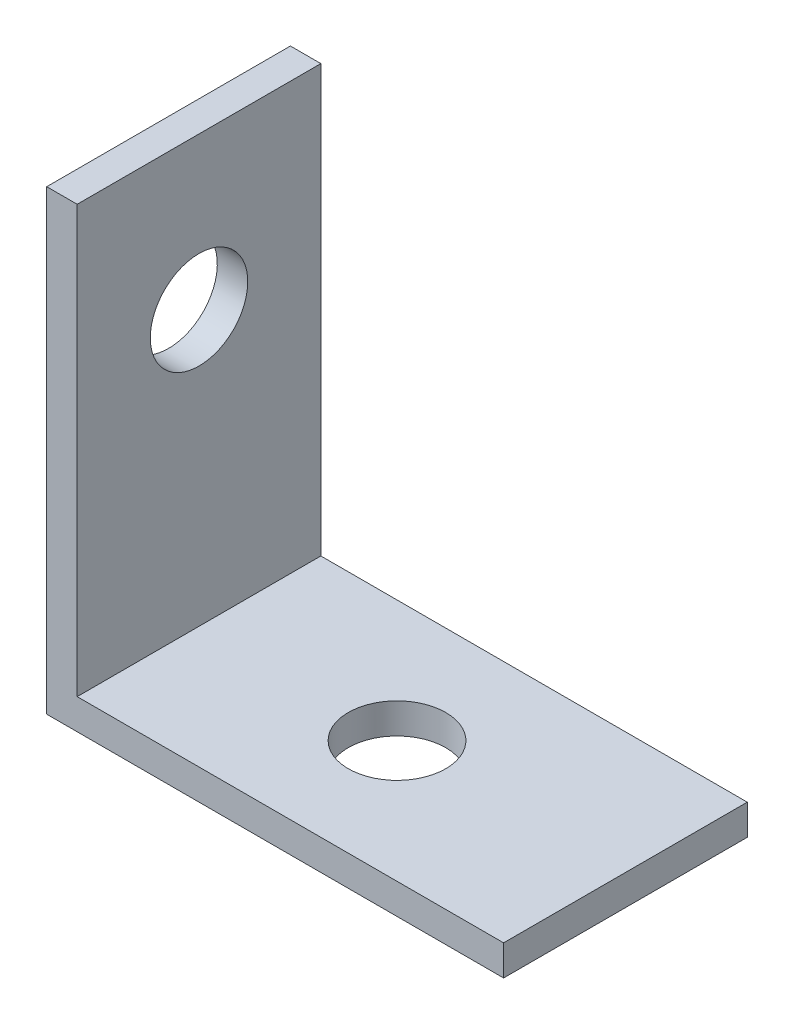
ISO-10303-21;
HEADER;
FILE_DESCRIPTION(('STEP AP214'),'2;1');
FILE_NAME('part.step','',(''),(''),'','','');
FILE_SCHEMA(('AUTOMOTIVE_DESIGN { 1 0 10303 214 1 1 1 1 }'));
ENDSEC;
DATA;
#1=APPLICATION_CONTEXT('core data for automotive mechanical design processes');
#2=APPLICATION_PROTOCOL_DEFINITION('international standard','automotive_design',2000,#1);
#3=PRODUCT_CONTEXT('',#1,'mechanical');
#4=PRODUCT('Part','Part','',(#3));
#5=PRODUCT_RELATED_PRODUCT_CATEGORY('part','',(#4));
#6=PRODUCT_DEFINITION_FORMATION('','',#4);
#7=PRODUCT_DEFINITION_CONTEXT('part definition',#1,'design');
#8=PRODUCT_DEFINITION('design','',#6,#7);
#9=PRODUCT_DEFINITION_SHAPE('','',#8);
#10=(LENGTH_UNIT() NAMED_UNIT(*) SI_UNIT(.MILLI.,.METRE.));
#11=(NAMED_UNIT(*) PLANE_ANGLE_UNIT() SI_UNIT($,.RADIAN.));
#12=(NAMED_UNIT(*) SI_UNIT($,.STERADIAN.) SOLID_ANGLE_UNIT());
#13=UNCERTAINTY_MEASURE_WITH_UNIT(LENGTH_MEASURE(1.E-05),#10,'distance_accuracy_value','');
#14=(GEOMETRIC_REPRESENTATION_CONTEXT(3) GLOBAL_UNCERTAINTY_ASSIGNED_CONTEXT((#13)) GLOBAL_UNIT_ASSIGNED_CONTEXT((#10,
#11,#12)) REPRESENTATION_CONTEXT('',''));
#15=CARTESIAN_POINT('',(0.,0.,0.));
#16=DIRECTION('',(0.,0.,1.));
#17=DIRECTION('',(1.,0.,0.));
#18=AXIS2_PLACEMENT_3D('',#15,#16,#17);
#19=CARTESIAN_POINT('',(0.,15.,8.));
#20=DIRECTION('',(1.,0.,0.));
#21=DIRECTION('',(0.,1.,0.));
#22=AXIS2_PLACEMENT_3D('',#19,#20,#21);
#23=PLANE('',#22);
#24=CARTESIAN_POINT('',(0.,9.99999999999993,4.00000000000003));
#25=DIRECTION('',(1.,0.,0.));
#26=DIRECTION('',(0.,1.,0.));
#27=AXIS2_PLACEMENT_3D('',#24,#25,#26);
#28=CIRCLE('',#27,1.6);
#29=CARTESIAN_POINT('',(0.,11.5999999999999,4.00000000000003));
#30=VERTEX_POINT('',#29);
#31=EDGE_CURVE('E125',#30,#30,#28,.T.);
#32=ORIENTED_EDGE('',*,*,#31,.T.);
#33=EDGE_LOOP('',(#32));
#34=FACE_BOUND('',#33,.T.);
#35=DIRECTION('',(0.,-1.,0.));
#36=VECTOR('',#35,1.);
#37=CARTESIAN_POINT('',(0.,15.,0.));
#38=LINE('',#37,#36);
#39=CARTESIAN_POINT('',(0.,15.,0.));
#40=VERTEX_POINT('',#39);
#41=CARTESIAN_POINT('',(0.,0.,0.));
#42=VERTEX_POINT('',#41);
#43=EDGE_CURVE('E121',#40,#42,#38,.T.);
#44=ORIENTED_EDGE('',*,*,#43,.T.);
#45=DIRECTION('',(0.,0.,-1.));
#46=VECTOR('',#45,1.);
#47=CARTESIAN_POINT('',(0.,0.,8.));
#48=LINE('',#47,#46);
#49=CARTESIAN_POINT('',(0.,0.,8.));
#50=VERTEX_POINT('',#49);
#51=EDGE_CURVE('E11',#50,#42,#48,.T.);
#52=ORIENTED_EDGE('',*,*,#51,.F.);
#53=DIRECTION('',(0.,-1.,0.));
#54=VECTOR('',#53,1.);
#55=CARTESIAN_POINT('',(0.,15.,8.));
#56=LINE('',#55,#54);
#57=CARTESIAN_POINT('',(0.,15.,8.));
#58=VERTEX_POINT('',#57);
#59=EDGE_CURVE('E132',#58,#50,#56,.T.);
#60=ORIENTED_EDGE('',*,*,#59,.F.);
#61=DIRECTION('',(0.,0.,-1.));
#62=VECTOR('',#61,1.);
#63=CARTESIAN_POINT('',(0.,15.,8.));
#64=LINE('',#63,#62);
#65=EDGE_CURVE('E117',#58,#40,#64,.T.);
#66=ORIENTED_EDGE('',*,*,#65,.T.);
#67=EDGE_LOOP('',(#44,#52,#60,#66));
#68=FACE_BOUND('',#67,.T.);
#69=ADVANCED_FACE('F36',(#34,#68),#23,.F.);
#70=CARTESIAN_POINT('',(0.,0.,8.));
#71=DIRECTION('',(0.,1.,0.));
#72=DIRECTION('',(0.,0.,1.));
#73=AXIS2_PLACEMENT_3D('',#70,#71,#72);
#74=PLANE('',#73);
#75=CARTESIAN_POINT('',(7.5,0.,4.));
#76=DIRECTION('',(0.,-1.,0.));
#77=DIRECTION('',(0.,0.,-1.));
#78=AXIS2_PLACEMENT_3D('',#75,#76,#77);
#79=CIRCLE('',#78,1.6);
#80=CARTESIAN_POINT('',(7.5,0.,2.4));
#81=VERTEX_POINT('',#80);
#82=EDGE_CURVE('E172',#81,#81,#79,.T.);
#83=ORIENTED_EDGE('',*,*,#82,.F.);
#84=EDGE_LOOP('',(#83));
#85=FACE_BOUND('',#84,.T.);
#86=DIRECTION('',(1.,0.,0.));
#87=VECTOR('',#86,1.);
#88=CARTESIAN_POINT('',(0.,0.,0.));
#89=LINE('',#88,#87);
#90=CARTESIAN_POINT('',(15.,0.,0.));
#91=VERTEX_POINT('',#90);
#92=EDGE_CURVE('E124',#42,#91,#89,.T.);
#93=ORIENTED_EDGE('',*,*,#92,.T.);
#94=DIRECTION('',(0.,0.,-1.));
#95=VECTOR('',#94,1.);
#96=CARTESIAN_POINT('',(15.,0.,8.));
#97=LINE('',#96,#95);
#98=CARTESIAN_POINT('',(15.,0.,8.));
#99=VERTEX_POINT('',#98);
#100=EDGE_CURVE('E45',#99,#91,#97,.T.);
#101=ORIENTED_EDGE('',*,*,#100,.F.);
#102=DIRECTION('',(1.,0.,0.));
#103=VECTOR('',#102,1.);
#104=CARTESIAN_POINT('',(0.,0.,8.));
#105=LINE('',#104,#103);
#106=EDGE_CURVE('E90',#50,#99,#105,.T.);
#107=ORIENTED_EDGE('',*,*,#106,.F.);
#108=ORIENTED_EDGE('',*,*,#51,.T.);
#109=EDGE_LOOP('',(#93,#101,#107,#108));
#110=FACE_BOUND('',#109,.T.);
#111=ADVANCED_FACE('F158',(#85,#110),#74,.F.);
#112=CARTESIAN_POINT('',(15.,0.,8.));
#113=DIRECTION('',(-1.,0.,0.));
#114=DIRECTION('',(0.,0.,1.));
#115=AXIS2_PLACEMENT_3D('',#112,#113,#114);
#116=PLANE('',#115);
#117=DIRECTION('',(0.,1.,0.));
#118=VECTOR('',#117,1.);
#119=CARTESIAN_POINT('',(15.,0.,0.));
#120=LINE('',#119,#118);
#121=CARTESIAN_POINT('',(15.,1.,0.));
#122=VERTEX_POINT('',#121);
#123=EDGE_CURVE('E127',#91,#122,#120,.T.);
#124=ORIENTED_EDGE('',*,*,#123,.T.);
#125=DIRECTION('',(0.,0.,-1.));
#126=VECTOR('',#125,1.);
#127=CARTESIAN_POINT('',(15.,1.,8.));
#128=LINE('',#127,#126);
#129=CARTESIAN_POINT('',(15.,1.,8.));
#130=VERTEX_POINT('',#129);
#131=EDGE_CURVE('E112',#130,#122,#128,.T.);
#132=ORIENTED_EDGE('',*,*,#131,.F.);
#133=DIRECTION('',(0.,1.,0.));
#134=VECTOR('',#133,1.);
#135=CARTESIAN_POINT('',(15.,0.,8.));
#136=LINE('',#135,#134);
#137=EDGE_CURVE('E103',#99,#130,#136,.T.);
#138=ORIENTED_EDGE('',*,*,#137,.F.);
#139=ORIENTED_EDGE('',*,*,#100,.T.);
#140=EDGE_LOOP('',(#124,#132,#138,#139));
#141=FACE_BOUND('',#140,.T.);
#142=ADVANCED_FACE('F139',(#141),#116,.F.);
#143=CARTESIAN_POINT('',(15.,1.,8.));
#144=DIRECTION('',(0.,-1.,0.));
#145=DIRECTION('',(1.,0.,0.));
#146=AXIS2_PLACEMENT_3D('',#143,#144,#145);
#147=PLANE('',#146);
#148=CARTESIAN_POINT('',(7.5,0.999999999999999,4.));
#149=DIRECTION('',(0.,-1.,0.));
#150=DIRECTION('',(1.,0.,0.));
#151=AXIS2_PLACEMENT_3D('',#148,#149,#150);
#152=CIRCLE('',#151,1.6);
#153=CARTESIAN_POINT('',(9.1,0.999999999999999,4.));
#154=VERTEX_POINT('',#153);
#155=EDGE_CURVE('E39',#154,#154,#152,.T.);
#156=ORIENTED_EDGE('',*,*,#155,.T.);
#157=EDGE_LOOP('',(#156));
#158=FACE_BOUND('',#157,.T.);
#159=DIRECTION('',(-1.,0.,0.));
#160=VECTOR('',#159,1.);
#161=CARTESIAN_POINT('',(15.,1.,0.));
#162=LINE('',#161,#160);
#163=CARTESIAN_POINT('',(1.,0.999999999999998,0.));
#164=VERTEX_POINT('',#163);
#165=EDGE_CURVE('E111',#122,#164,#162,.T.);
#166=ORIENTED_EDGE('',*,*,#165,.T.);
#167=DIRECTION('',(0.,0.,-1.));
#168=VECTOR('',#167,1.);
#169=CARTESIAN_POINT('',(1.,0.999999999999998,8.));
#170=LINE('',#169,#168);
#171=CARTESIAN_POINT('',(1.,0.999999999999998,8.));
#172=VERTEX_POINT('',#171);
#173=EDGE_CURVE('E108',#172,#164,#170,.T.);
#174=ORIENTED_EDGE('',*,*,#173,.F.);
#175=DIRECTION('',(-1.,0.,0.));
#176=VECTOR('',#175,1.);
#177=CARTESIAN_POINT('',(15.,1.,8.));
#178=LINE('',#177,#176);
#179=EDGE_CURVE('E97',#130,#172,#178,.T.);
#180=ORIENTED_EDGE('',*,*,#179,.F.);
#181=ORIENTED_EDGE('',*,*,#131,.T.);
#182=EDGE_LOOP('',(#166,#174,#180,#181));
#183=FACE_BOUND('',#182,.T.);
#184=ADVANCED_FACE('F109',(#158,#183),#147,.F.);
#185=CARTESIAN_POINT('',(1.,0.999999999999998,8.));
#186=DIRECTION('',(-1.,0.,0.));
#187=DIRECTION('',(0.,-1.,0.));
#188=AXIS2_PLACEMENT_3D('',#185,#186,#187);
#189=PLANE('',#188);
#190=CARTESIAN_POINT('',(1.,9.99999999999993,4.00000000000003));
#191=DIRECTION('',(1.,0.,0.));
#192=DIRECTION('',(0.,1.,0.));
#193=AXIS2_PLACEMENT_3D('',#190,#191,#192);
#194=CIRCLE('',#193,1.6);
#195=CARTESIAN_POINT('',(1.,11.5999999999999,4.00000000000003));
#196=VERTEX_POINT('',#195);
#197=EDGE_CURVE('E167',#196,#196,#194,.T.);
#198=ORIENTED_EDGE('',*,*,#197,.F.);
#199=EDGE_LOOP('',(#198));
#200=FACE_BOUND('',#199,.T.);
#201=DIRECTION('',(0.,1.,0.));
#202=VECTOR('',#201,1.);
#203=CARTESIAN_POINT('',(1.,0.999999999999998,0.));
#204=LINE('',#203,#202);
#205=CARTESIAN_POINT('',(1.,15.,0.));
#206=VERTEX_POINT('',#205);
#207=EDGE_CURVE('E76',#164,#206,#204,.T.);
#208=ORIENTED_EDGE('',*,*,#207,.T.);
#209=DIRECTION('',(0.,0.,-1.));
#210=VECTOR('',#209,1.);
#211=CARTESIAN_POINT('',(1.,15.,8.));
#212=LINE('',#211,#210);
#213=CARTESIAN_POINT('',(1.,15.,8.));
#214=VERTEX_POINT('',#213);
#215=EDGE_CURVE('E113',#214,#206,#212,.T.);
#216=ORIENTED_EDGE('',*,*,#215,.F.);
#217=DIRECTION('',(0.,1.,0.));
#218=VECTOR('',#217,1.);
#219=CARTESIAN_POINT('',(1.,0.999999999999998,8.));
#220=LINE('',#219,#218);
#221=EDGE_CURVE('E101',#172,#214,#220,.T.);
#222=ORIENTED_EDGE('',*,*,#221,.F.);
#223=ORIENTED_EDGE('',*,*,#173,.T.);
#224=EDGE_LOOP('',(#208,#216,#222,#223));
#225=FACE_BOUND('',#224,.T.);
#226=ADVANCED_FACE('F115',(#200,#225),#189,.F.);
#227=CARTESIAN_POINT('',(1.,15.,8.));
#228=DIRECTION('',(0.,-1.,0.));
#229=DIRECTION('',(0.,0.,-1.));
#230=AXIS2_PLACEMENT_3D('',#227,#228,#229);
#231=PLANE('',#230);
#232=DIRECTION('',(-1.,0.,0.));
#233=VECTOR('',#232,1.);
#234=CARTESIAN_POINT('',(1.,15.,0.));
#235=LINE('',#234,#233);
#236=EDGE_CURVE('E82',#206,#40,#235,.T.);
#237=ORIENTED_EDGE('',*,*,#236,.T.);
#238=ORIENTED_EDGE('',*,*,#65,.F.);
#239=DIRECTION('',(-1.,0.,0.));
#240=VECTOR('',#239,1.);
#241=CARTESIAN_POINT('',(1.,15.,8.));
#242=LINE('',#241,#240);
#243=EDGE_CURVE('E53',#214,#58,#242,.T.);
#244=ORIENTED_EDGE('',*,*,#243,.F.);
#245=ORIENTED_EDGE('',*,*,#215,.T.);
#246=EDGE_LOOP('',(#237,#238,#244,#245));
#247=FACE_BOUND('',#246,.T.);
#248=ADVANCED_FACE('F146',(#247),#231,.F.);
#249=CARTESIAN_POINT('',(0.,0.,8.));
#250=DIRECTION('',(0.,0.,1.));
#251=DIRECTION('',(1.,0.,0.));
#252=AXIS2_PLACEMENT_3D('',#249,#250,#251);
#253=PLANE('',#252);
#254=ORIENTED_EDGE('',*,*,#59,.T.);
#255=ORIENTED_EDGE('',*,*,#106,.T.);
#256=ORIENTED_EDGE('',*,*,#137,.T.);
#257=ORIENTED_EDGE('',*,*,#179,.T.);
#258=ORIENTED_EDGE('',*,*,#221,.T.);
#259=ORIENTED_EDGE('',*,*,#243,.T.);
#260=EDGE_LOOP('',(#254,#255,#256,#257,#258,#259));
#261=FACE_BOUND('',#260,.T.);
#262=ADVANCED_FACE('F99',(#261),#253,.T.);
#263=CARTESIAN_POINT('',(0.,0.,0.));
#264=DIRECTION('',(0.,0.,1.));
#265=DIRECTION('',(1.,0.,0.));
#266=AXIS2_PLACEMENT_3D('',#263,#264,#265);
#267=PLANE('',#266);
#268=ORIENTED_EDGE('',*,*,#43,.F.);
#269=ORIENTED_EDGE('',*,*,#236,.F.);
#270=ORIENTED_EDGE('',*,*,#207,.F.);
#271=ORIENTED_EDGE('',*,*,#165,.F.);
#272=ORIENTED_EDGE('',*,*,#123,.F.);
#273=ORIENTED_EDGE('',*,*,#92,.F.);
#274=EDGE_LOOP('',(#268,#269,#270,#271,#272,#273));
#275=FACE_BOUND('',#274,.T.);
#276=ADVANCED_FACE('F142',(#275),#267,.F.);
#277=CARTESIAN_POINT('',(0.,9.99999999999993,4.00000000000003));
#278=DIRECTION('',(1.,0.,0.));
#279=DIRECTION('',(0.,1.,0.));
#280=AXIS2_PLACEMENT_3D('',#277,#278,#279);
#281=CYLINDRICAL_SURFACE('',#280,1.6);
#282=ORIENTED_EDGE('',*,*,#31,.F.);
#283=EDGE_LOOP('',(#282));
#284=FACE_BOUND('',#283,.T.);
#285=ORIENTED_EDGE('',*,*,#197,.T.);
#286=EDGE_LOOP('',(#285));
#287=FACE_BOUND('',#286,.T.);
#288=ADVANCED_FACE('F184',(#284,#287),#281,.F.);
#289=CARTESIAN_POINT('',(7.5,15.,4.));
#290=DIRECTION('',(0.,-1.,0.));
#291=DIRECTION('',(0.,0.,-1.));
#292=AXIS2_PLACEMENT_3D('',#289,#290,#291);
#293=CYLINDRICAL_SURFACE('',#292,1.6);
#294=ORIENTED_EDGE('',*,*,#82,.T.);
#295=EDGE_LOOP('',(#294));
#296=FACE_BOUND('',#295,.T.);
#297=ORIENTED_EDGE('',*,*,#155,.F.);
#298=EDGE_LOOP('',(#297));
#299=FACE_BOUND('',#298,.T.);
#300=ADVANCED_FACE('F182',(#296,#299),#293,.F.);
#301=CLOSED_SHELL('',(#69,#111,#142,#184,#226,#248,#262,#276,#288,#300));
#302=MANIFOLD_SOLID_BREP('B2',#301);
#303=ADVANCED_BREP_SHAPE_REPRESENTATION('',(#18,#302),#14);
#304=SHAPE_DEFINITION_REPRESENTATION(#9,#303);
ENDSEC;
END-ISO-10303-21;
